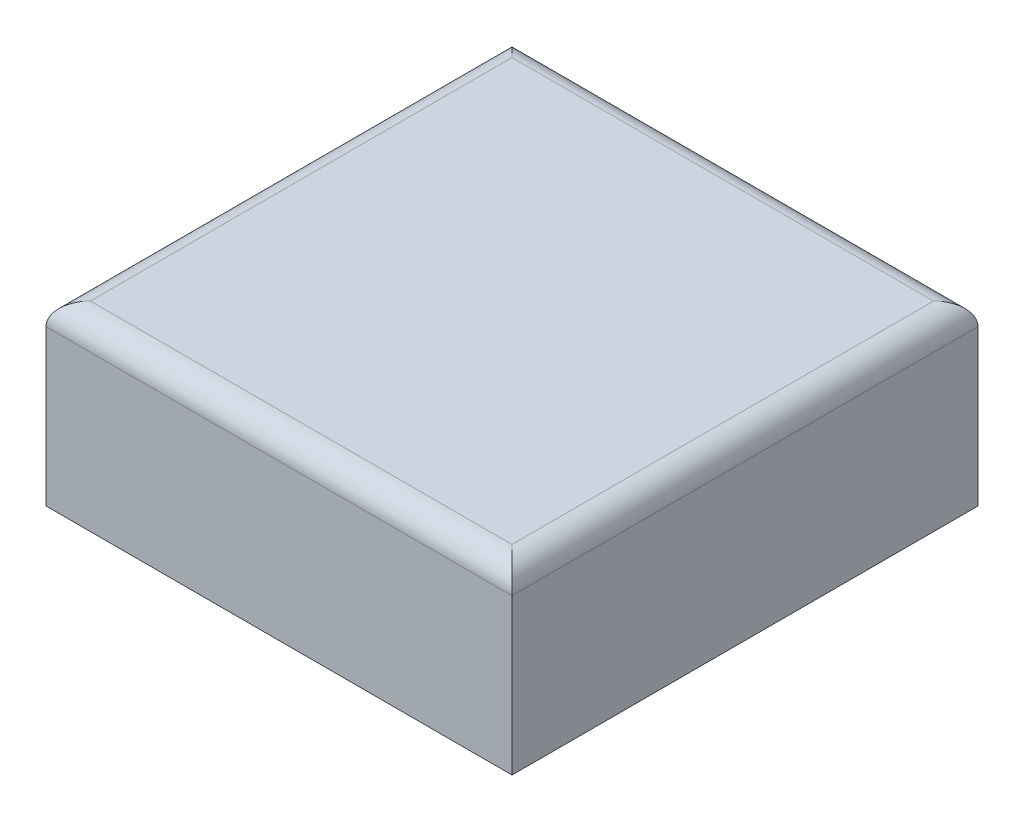
ISO-10303-21;
HEADER;
FILE_DESCRIPTION(('STEP AP214'),'2;1');
FILE_NAME('part.step','',(''),(''),'','','');
FILE_SCHEMA(('AUTOMOTIVE_DESIGN { 1 0 10303 214 1 1 1 1 }'));
ENDSEC;
DATA;
#1=APPLICATION_CONTEXT('core data for automotive mechanical design processes');
#2=APPLICATION_PROTOCOL_DEFINITION('international standard','automotive_design',2000,#1);
#3=PRODUCT_CONTEXT('',#1,'mechanical');
#4=PRODUCT('Part','Part','',(#3));
#5=PRODUCT_RELATED_PRODUCT_CATEGORY('part','',(#4));
#6=PRODUCT_DEFINITION_FORMATION('','',#4);
#7=PRODUCT_DEFINITION_CONTEXT('part definition',#1,'design');
#8=PRODUCT_DEFINITION('design','',#6,#7);
#9=PRODUCT_DEFINITION_SHAPE('','',#8);
#10=(LENGTH_UNIT() NAMED_UNIT(*) SI_UNIT(.MILLI.,.METRE.));
#11=(NAMED_UNIT(*) PLANE_ANGLE_UNIT() SI_UNIT($,.RADIAN.));
#12=(NAMED_UNIT(*) SI_UNIT($,.STERADIAN.) SOLID_ANGLE_UNIT());
#13=UNCERTAINTY_MEASURE_WITH_UNIT(LENGTH_MEASURE(1.E-05),#10,'distance_accuracy_value','');
#14=(GEOMETRIC_REPRESENTATION_CONTEXT(3) GLOBAL_UNCERTAINTY_ASSIGNED_CONTEXT((#13)) GLOBAL_UNIT_ASSIGNED_CONTEXT((#10,
#11,#12)) REPRESENTATION_CONTEXT('',''));
#15=CARTESIAN_POINT('',(0.,0.,0.));
#16=DIRECTION('',(0.,0.,1.));
#17=DIRECTION('',(1.,0.,0.));
#18=AXIS2_PLACEMENT_3D('',#15,#16,#17);
#19=CARTESIAN_POINT('',(10.5,8.,-10.5));
#20=DIRECTION('',(-1.,0.,0.));
#21=DIRECTION('',(0.,0.,1.));
#22=AXIS2_PLACEMENT_3D('',#19,#20,#21);
#23=PLANE('',#22);
#24=DIRECTION('',(0.,-1.,0.));
#25=VECTOR('',#24,1.);
#26=CARTESIAN_POINT('',(10.5,8.,-10.5));
#27=LINE('',#26,#25);
#28=CARTESIAN_POINT('',(10.5,7.,-10.5));
#29=VERTEX_POINT('',#28);
#30=CARTESIAN_POINT('',(10.5,0.,-10.5));
#31=VERTEX_POINT('',#30);
#32=EDGE_CURVE('E92',#29,#31,#27,.T.);
#33=ORIENTED_EDGE('',*,*,#32,.F.);
#34=DIRECTION('',(0.,0.,-1.));
#35=VECTOR('',#34,1.);
#36=CARTESIAN_POINT('',(10.5,7.,10.5));
#37=LINE('',#36,#35);
#38=CARTESIAN_POINT('',(10.5,7.,10.5));
#39=VERTEX_POINT('',#38);
#40=EDGE_CURVE('E49',#29,#39,#37,.F.);
#41=ORIENTED_EDGE('',*,*,#40,.T.);
#42=DIRECTION('',(0.,-1.,0.));
#43=VECTOR('',#42,1.);
#44=CARTESIAN_POINT('',(10.5,8.,10.5));
#45=LINE('',#44,#43);
#46=CARTESIAN_POINT('',(10.5,0.,10.5));
#47=VERTEX_POINT('',#46);
#48=EDGE_CURVE('E111',#39,#47,#45,.T.);
#49=ORIENTED_EDGE('',*,*,#48,.T.);
#50=DIRECTION('',(0.,0.,-1.));
#51=VECTOR('',#50,1.);
#52=CARTESIAN_POINT('',(10.5,0.,-10.5));
#53=LINE('',#52,#51);
#54=EDGE_CURVE('E106',#47,#31,#53,.T.);
#55=ORIENTED_EDGE('',*,*,#54,.T.);
#56=EDGE_LOOP('',(#33,#41,#49,#55));
#57=FACE_BOUND('',#56,.T.);
#58=ADVANCED_FACE('F39',(#57),#23,.F.);
#59=CARTESIAN_POINT('',(-10.5,8.,-10.5));
#60=DIRECTION('',(0.,0.,1.));
#61=DIRECTION('',(1.,0.,0.));
#62=AXIS2_PLACEMENT_3D('',#59,#60,#61);
#63=PLANE('',#62);
#64=DIRECTION('',(0.,-1.,0.));
#65=VECTOR('',#64,1.);
#66=CARTESIAN_POINT('',(-10.5,8.,-10.5));
#67=LINE('',#66,#65);
#68=CARTESIAN_POINT('',(-10.5,7.,-10.5));
#69=VERTEX_POINT('',#68);
#70=CARTESIAN_POINT('',(-10.5,0.,-10.5));
#71=VERTEX_POINT('',#70);
#72=EDGE_CURVE('E100',#69,#71,#67,.T.);
#73=ORIENTED_EDGE('',*,*,#72,.F.);
#74=DIRECTION('',(-1.,0.,0.));
#75=VECTOR('',#74,1.);
#76=CARTESIAN_POINT('',(10.5,7.,-10.5));
#77=LINE('',#76,#75);
#78=EDGE_CURVE('E64',#69,#29,#77,.F.);
#79=ORIENTED_EDGE('',*,*,#78,.T.);
#80=ORIENTED_EDGE('',*,*,#32,.T.);
#81=DIRECTION('',(-1.,0.,0.));
#82=VECTOR('',#81,1.);
#83=CARTESIAN_POINT('',(-10.5,0.,-10.5));
#84=LINE('',#83,#82);
#85=EDGE_CURVE('E95',#31,#71,#84,.T.);
#86=ORIENTED_EDGE('',*,*,#85,.T.);
#87=EDGE_LOOP('',(#73,#79,#80,#86));
#88=FACE_BOUND('',#87,.T.);
#89=ADVANCED_FACE('F94',(#88),#63,.F.);
#90=CARTESIAN_POINT('',(-10.5,8.,-10.5));
#91=DIRECTION('',(1.,0.,0.));
#92=DIRECTION('',(0.,0.,-1.));
#93=AXIS2_PLACEMENT_3D('',#90,#91,#92);
#94=PLANE('',#93);
#95=DIRECTION('',(0.,-1.,0.));
#96=VECTOR('',#95,1.);
#97=CARTESIAN_POINT('',(-10.5,8.,10.5));
#98=LINE('',#97,#96);
#99=CARTESIAN_POINT('',(-10.5,7.,10.5));
#100=VERTEX_POINT('',#99);
#101=CARTESIAN_POINT('',(-10.5,0.,10.5));
#102=VERTEX_POINT('',#101);
#103=EDGE_CURVE('E126',#100,#102,#98,.T.);
#104=ORIENTED_EDGE('',*,*,#103,.F.);
#105=DIRECTION('',(0.,0.,1.));
#106=VECTOR('',#105,1.);
#107=CARTESIAN_POINT('',(-10.5,7.,-10.5));
#108=LINE('',#107,#106);
#109=EDGE_CURVE('E143',#100,#69,#108,.F.);
#110=ORIENTED_EDGE('',*,*,#109,.T.);
#111=ORIENTED_EDGE('',*,*,#72,.T.);
#112=DIRECTION('',(0.,0.,1.));
#113=VECTOR('',#112,1.);
#114=CARTESIAN_POINT('',(-10.5,0.,-10.5));
#115=LINE('',#114,#113);
#116=EDGE_CURVE('E108',#71,#102,#115,.T.);
#117=ORIENTED_EDGE('',*,*,#116,.T.);
#118=EDGE_LOOP('',(#104,#110,#111,#117));
#119=FACE_BOUND('',#118,.T.);
#120=ADVANCED_FACE('F177',(#119),#94,.F.);
#121=CARTESIAN_POINT('',(-10.5,8.,10.5));
#122=DIRECTION('',(0.,0.,-1.));
#123=DIRECTION('',(-1.,0.,0.));
#124=AXIS2_PLACEMENT_3D('',#121,#122,#123);
#125=PLANE('',#124);
#126=ORIENTED_EDGE('',*,*,#48,.F.);
#127=DIRECTION('',(1.,0.,0.));
#128=VECTOR('',#127,1.);
#129=CARTESIAN_POINT('',(-10.5,7.,10.5));
#130=LINE('',#129,#128);
#131=EDGE_CURVE('E11',#39,#100,#130,.F.);
#132=ORIENTED_EDGE('',*,*,#131,.T.);
#133=ORIENTED_EDGE('',*,*,#103,.T.);
#134=DIRECTION('',(1.,0.,0.));
#135=VECTOR('',#134,1.);
#136=CARTESIAN_POINT('',(-10.5,0.,10.5));
#137=LINE('',#136,#135);
#138=EDGE_CURVE('E121',#102,#47,#137,.T.);
#139=ORIENTED_EDGE('',*,*,#138,.T.);
#140=EDGE_LOOP('',(#126,#132,#133,#139));
#141=FACE_BOUND('',#140,.T.);
#142=ADVANCED_FACE('F179',(#141),#125,.F.);
#143=CARTESIAN_POINT('',(0.,8.,0.));
#144=DIRECTION('',(0.,1.,0.));
#145=DIRECTION('',(0.,0.,1.));
#146=AXIS2_PLACEMENT_3D('',#143,#144,#145);
#147=PLANE('',#146);
#148=DIRECTION('',(-1.,0.,0.));
#149=VECTOR('',#148,1.);
#150=CARTESIAN_POINT('',(-10.5,8.,-9.5));
#151=LINE('',#150,#149);
#152=CARTESIAN_POINT('',(9.5,8.,-9.5));
#153=VERTEX_POINT('',#152);
#154=CARTESIAN_POINT('',(-9.5,8.,-9.5));
#155=VERTEX_POINT('',#154);
#156=EDGE_CURVE('E136',#153,#155,#151,.T.);
#157=ORIENTED_EDGE('',*,*,#156,.T.);
#158=DIRECTION('',(0.,0.,1.));
#159=VECTOR('',#158,1.);
#160=CARTESIAN_POINT('',(-9.5,8.,10.5));
#161=LINE('',#160,#159);
#162=CARTESIAN_POINT('',(-9.5,8.,9.5));
#163=VERTEX_POINT('',#162);
#164=EDGE_CURVE('E139',#155,#163,#161,.T.);
#165=ORIENTED_EDGE('',*,*,#164,.T.);
#166=DIRECTION('',(1.,0.,0.));
#167=VECTOR('',#166,1.);
#168=CARTESIAN_POINT('',(10.5,8.,9.5));
#169=LINE('',#168,#167);
#170=CARTESIAN_POINT('',(9.5,8.,9.5));
#171=VERTEX_POINT('',#170);
#172=EDGE_CURVE('E99',#163,#171,#169,.T.);
#173=ORIENTED_EDGE('',*,*,#172,.T.);
#174=DIRECTION('',(0.,0.,-1.));
#175=VECTOR('',#174,1.);
#176=CARTESIAN_POINT('',(9.5,8.,-10.5));
#177=LINE('',#176,#175);
#178=EDGE_CURVE('E133',#171,#153,#177,.T.);
#179=ORIENTED_EDGE('',*,*,#178,.T.);
#180=EDGE_LOOP('',(#157,#165,#173,#179));
#181=FACE_BOUND('',#180,.T.);
#182=ADVANCED_FACE('F169',(#181),#147,.T.);
#183=CARTESIAN_POINT('',(0.,0.,0.));
#184=DIRECTION('',(0.,1.,0.));
#185=DIRECTION('',(0.,0.,1.));
#186=AXIS2_PLACEMENT_3D('',#183,#184,#185);
#187=PLANE('',#186);
#188=ORIENTED_EDGE('',*,*,#54,.F.);
#189=ORIENTED_EDGE('',*,*,#138,.F.);
#190=ORIENTED_EDGE('',*,*,#116,.F.);
#191=ORIENTED_EDGE('',*,*,#85,.F.);
#192=EDGE_LOOP('',(#188,#189,#190,#191));
#193=FACE_BOUND('',#192,.T.);
#194=ADVANCED_FACE('F104',(#193),#187,.F.);
#195=CARTESIAN_POINT('',(9.5,7.,0.));
#196=DIRECTION('',(0.,0.,1.));
#197=DIRECTION('',(1.,0.,0.));
#198=AXIS2_PLACEMENT_3D('',#195,#196,#197);
#199=CYLINDRICAL_SURFACE('',#198,1.);
#200=CARTESIAN_POINT('',(9.5,7.,9.5));
#201=DIRECTION('',(-0.707106781186547,0.,0.707106781186547));
#202=DIRECTION('',(-0.707106781186547,0.,-0.707106781186547));
#203=AXIS2_PLACEMENT_3D('',#200,#201,#202);
#204=ELLIPSE('',#203,1.41421356237309,1.);
#205=EDGE_CURVE('E117',#39,#171,#204,.T.);
#206=ORIENTED_EDGE('',*,*,#205,.F.);
#207=ORIENTED_EDGE('',*,*,#40,.F.);
#208=CARTESIAN_POINT('',(9.5,7.,-9.5));
#209=DIRECTION('',(0.707106781186547,0.,0.707106781186547));
#210=DIRECTION('',(-0.707106781186547,0.,0.707106781186547));
#211=AXIS2_PLACEMENT_3D('',#208,#209,#210);
#212=ELLIPSE('',#211,1.41421356237309,1.);
#213=EDGE_CURVE('E43',#153,#29,#212,.F.);
#214=ORIENTED_EDGE('',*,*,#213,.F.);
#215=ORIENTED_EDGE('',*,*,#178,.F.);
#216=EDGE_LOOP('',(#206,#207,#214,#215));
#217=FACE_BOUND('',#216,.T.);
#218=ADVANCED_FACE('F41',(#217),#199,.T.);
#219=CARTESIAN_POINT('',(0.,7.,-9.5));
#220=DIRECTION('',(1.,0.,0.));
#221=DIRECTION('',(0.,0.,-1.));
#222=AXIS2_PLACEMENT_3D('',#219,#220,#221);
#223=CYLINDRICAL_SURFACE('',#222,1.);
#224=ORIENTED_EDGE('',*,*,#213,.T.);
#225=ORIENTED_EDGE('',*,*,#78,.F.);
#226=CARTESIAN_POINT('',(-9.5,7.,-9.5));
#227=DIRECTION('',(0.707106781186547,0.,-0.707106781186547));
#228=DIRECTION('',(0.707106781186547,0.,0.707106781186547));
#229=AXIS2_PLACEMENT_3D('',#226,#227,#228);
#230=ELLIPSE('',#229,1.41421356237309,1.);
#231=EDGE_CURVE('E154',#155,#69,#230,.F.);
#232=ORIENTED_EDGE('',*,*,#231,.F.);
#233=ORIENTED_EDGE('',*,*,#156,.F.);
#234=EDGE_LOOP('',(#224,#225,#232,#233));
#235=FACE_BOUND('',#234,.T.);
#236=ADVANCED_FACE('F199',(#235),#223,.T.);
#237=CARTESIAN_POINT('',(0.,7.,9.5));
#238=DIRECTION('',(-1.,0.,0.));
#239=DIRECTION('',(0.,0.,1.));
#240=AXIS2_PLACEMENT_3D('',#237,#238,#239);
#241=CYLINDRICAL_SURFACE('',#240,1.);
#242=ORIENTED_EDGE('',*,*,#205,.T.);
#243=ORIENTED_EDGE('',*,*,#172,.F.);
#244=CARTESIAN_POINT('',(-9.5,7.,9.5));
#245=DIRECTION('',(-0.707106781186547,0.,-0.707106781186547));
#246=DIRECTION('',(-0.707106781186547,0.,0.707106781186547));
#247=AXIS2_PLACEMENT_3D('',#244,#245,#246);
#248=ELLIPSE('',#247,1.41421356237309,1.);
#249=EDGE_CURVE('E151',#100,#163,#248,.T.);
#250=ORIENTED_EDGE('',*,*,#249,.F.);
#251=ORIENTED_EDGE('',*,*,#131,.F.);
#252=EDGE_LOOP('',(#242,#243,#250,#251));
#253=FACE_BOUND('',#252,.T.);
#254=ADVANCED_FACE('F162',(#253),#241,.T.);
#255=CARTESIAN_POINT('',(-9.5,7.,0.));
#256=DIRECTION('',(0.,0.,-1.));
#257=DIRECTION('',(-1.,0.,0.));
#258=AXIS2_PLACEMENT_3D('',#255,#256,#257);
#259=CYLINDRICAL_SURFACE('',#258,1.);
#260=ORIENTED_EDGE('',*,*,#231,.T.);
#261=ORIENTED_EDGE('',*,*,#109,.F.);
#262=ORIENTED_EDGE('',*,*,#249,.T.);
#263=ORIENTED_EDGE('',*,*,#164,.F.);
#264=EDGE_LOOP('',(#260,#261,#262,#263));
#265=FACE_BOUND('',#264,.T.);
#266=ADVANCED_FACE('F173',(#265),#259,.T.);
#267=CLOSED_SHELL('',(#58,#89,#120,#142,#182,#194,#218,#236,#254,#266));
#268=MANIFOLD_SOLID_BREP('B2',#267);
#269=ADVANCED_BREP_SHAPE_REPRESENTATION('',(#18,#268),#14);
#270=SHAPE_DEFINITION_REPRESENTATION(#9,#269);
ENDSEC;
END-ISO-10303-21;
